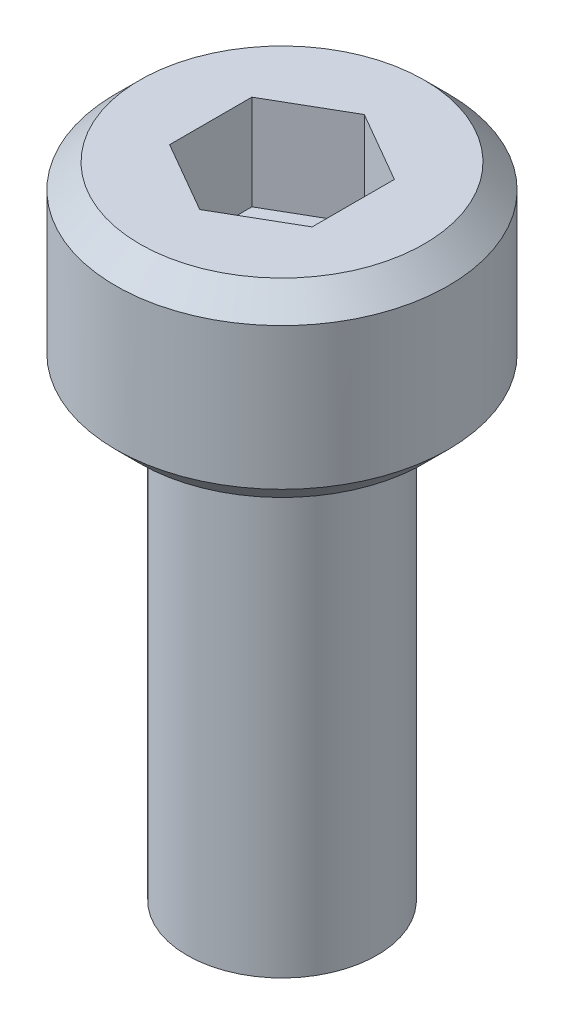
ISO-10303-21;
HEADER;
FILE_DESCRIPTION(('STEP AP214'),'2;1');
FILE_NAME('part.step','',(''),(''),'','','');
FILE_SCHEMA(('AUTOMOTIVE_DESIGN { 1 0 10303 214 1 1 1 1 }'));
ENDSEC;
DATA;
#1=APPLICATION_CONTEXT('core data for automotive mechanical design processes');
#2=APPLICATION_PROTOCOL_DEFINITION('international standard','automotive_design',2000,#1);
#3=PRODUCT_CONTEXT('',#1,'mechanical');
#4=PRODUCT('Part','Part','',(#3));
#5=PRODUCT_RELATED_PRODUCT_CATEGORY('part','',(#4));
#6=PRODUCT_DEFINITION_FORMATION('','',#4);
#7=PRODUCT_DEFINITION_CONTEXT('part definition',#1,'design');
#8=PRODUCT_DEFINITION('design','',#6,#7);
#9=PRODUCT_DEFINITION_SHAPE('','',#8);
#10=(LENGTH_UNIT() NAMED_UNIT(*) SI_UNIT(.MILLI.,.METRE.));
#11=(NAMED_UNIT(*) PLANE_ANGLE_UNIT() SI_UNIT($,.RADIAN.));
#12=(NAMED_UNIT(*) SI_UNIT($,.STERADIAN.) SOLID_ANGLE_UNIT());
#13=UNCERTAINTY_MEASURE_WITH_UNIT(LENGTH_MEASURE(1.E-05),#10,'distance_accuracy_value','');
#14=(GEOMETRIC_REPRESENTATION_CONTEXT(3) GLOBAL_UNCERTAINTY_ASSIGNED_CONTEXT((#13)) GLOBAL_UNIT_ASSIGNED_CONTEXT((#10,
#11,#12)) REPRESENTATION_CONTEXT('',''));
#15=CARTESIAN_POINT('',(0.,0.,0.));
#16=DIRECTION('',(0.,0.,1.));
#17=DIRECTION('',(1.,0.,0.));
#18=AXIS2_PLACEMENT_3D('',#15,#16,#17);
#19=CARTESIAN_POINT('',(0.,1.99999199999999,-1.73205080756887));
#20=DIRECTION('',(-0.5,0.,-0.866025403784439));
#21=DIRECTION('',(-0.866025403784439,0.,0.5));
#22=AXIS2_PLACEMENT_3D('',#19,#20,#21);
#23=PLANE('',#22);
#24=DIRECTION('',(0.,-1.,0.));
#25=VECTOR('',#24,1.);
#26=CARTESIAN_POINT('',(-1.49999999999999,1.99999199999999,-0.866025403784432));
#27=LINE('',#26,#25);
#28=CARTESIAN_POINT('',(-1.49999999999999,3.99999199999999,-0.866025403784429));
#29=VERTEX_POINT('',#28);
#30=CARTESIAN_POINT('',(-1.49999999999999,1.99999199999999,-0.866025403784429));
#31=VERTEX_POINT('',#30);
#32=EDGE_CURVE('E83',#29,#31,#27,.T.);
#33=ORIENTED_EDGE('',*,*,#32,.T.);
#34=DIRECTION('',(-0.866025403784439,0.,0.5));
#35=VECTOR('',#34,1.);
#36=CARTESIAN_POINT('',(0.,1.99999199999999,-1.73205080756887));
#37=LINE('',#36,#35);
#38=CARTESIAN_POINT('',(0.,1.999992,-1.73205080756887));
#39=VERTEX_POINT('',#38);
#40=EDGE_CURVE('E72',#39,#31,#37,.T.);
#41=ORIENTED_EDGE('',*,*,#40,.F.);
#42=DIRECTION('',(0.,1.,0.));
#43=VECTOR('',#42,1.);
#44=CARTESIAN_POINT('',(0.,1.99999200000003,-1.73205080756886));
#45=LINE('',#44,#43);
#46=CARTESIAN_POINT('',(0.,3.99999200000001,-1.73205080756887));
#47=VERTEX_POINT('',#46);
#48=EDGE_CURVE('E92',#39,#47,#45,.T.);
#49=ORIENTED_EDGE('',*,*,#48,.T.);
#50=DIRECTION('',(-0.866025403784439,0.,0.5));
#51=VECTOR('',#50,1.);
#52=CARTESIAN_POINT('',(0.,3.99999199999999,-1.73205080756887));
#53=LINE('',#52,#51);
#54=EDGE_CURVE('E67',#29,#47,#53,.F.);
#55=ORIENTED_EDGE('',*,*,#54,.F.);
#56=EDGE_LOOP('',(#33,#41,#49,#55));
#57=FACE_BOUND('',#56,.T.);
#58=ADVANCED_FACE('F17',(#57),#23,.F.);
#59=CARTESIAN_POINT('',(-1.49999999999999,1.99999199999999,-0.866025403784432));
#60=DIRECTION('',(-1.,0.,0.));
#61=DIRECTION('',(0.,-1.,0.));
#62=AXIS2_PLACEMENT_3D('',#59,#60,#61);
#63=PLANE('',#62);
#64=DIRECTION('',(0.,1.,0.));
#65=VECTOR('',#64,1.);
#66=CARTESIAN_POINT('',(-1.49999999999999,1.99999199999999,0.866025403784441));
#67=LINE('',#66,#65);
#68=CARTESIAN_POINT('',(-1.49999999999999,3.99999199999999,0.866025403784443));
#69=VERTEX_POINT('',#68);
#70=CARTESIAN_POINT('',(-1.49999999999999,1.99999199999999,0.866025403784439));
#71=VERTEX_POINT('',#70);
#72=EDGE_CURVE('E88',#69,#71,#67,.F.);
#73=ORIENTED_EDGE('',*,*,#72,.T.);
#74=DIRECTION('',(0.,0.,1.));
#75=VECTOR('',#74,1.);
#76=CARTESIAN_POINT('',(-1.49999999999999,1.99999199999999,-0.866025403784432));
#77=LINE('',#76,#75);
#78=EDGE_CURVE('E76',#31,#71,#77,.T.);
#79=ORIENTED_EDGE('',*,*,#78,.F.);
#80=ORIENTED_EDGE('',*,*,#32,.F.);
#81=DIRECTION('',(0.,0.,1.));
#82=VECTOR('',#81,1.);
#83=CARTESIAN_POINT('',(-1.49999999999999,3.99999199999999,-0.866025403784432));
#84=LINE('',#83,#82);
#85=EDGE_CURVE('E90',#69,#29,#84,.F.);
#86=ORIENTED_EDGE('',*,*,#85,.F.);
#87=EDGE_LOOP('',(#73,#79,#80,#86));
#88=FACE_BOUND('',#87,.T.);
#89=ADVANCED_FACE('F86',(#88),#63,.F.);
#90=CARTESIAN_POINT('',(1.50000000000001,1.99999200000003,-0.866025403784422));
#91=DIRECTION('',(0.5,0.,-0.866025403784439));
#92=DIRECTION('',(-0.866025403784439,0.,-0.5));
#93=AXIS2_PLACEMENT_3D('',#90,#91,#92);
#94=PLANE('',#93);
#95=ORIENTED_EDGE('',*,*,#48,.F.);
#96=DIRECTION('',(-0.866025403784436,0.,-0.500000000000005));
#97=VECTOR('',#96,1.);
#98=CARTESIAN_POINT('',(1.50000000000001,1.99999199999999,-0.866025403784422));
#99=LINE('',#98,#97);
#100=CARTESIAN_POINT('',(1.5,1.999992,-0.866025403784425));
#101=VERTEX_POINT('',#100);
#102=EDGE_CURVE('E79',#101,#39,#99,.T.);
#103=ORIENTED_EDGE('',*,*,#102,.F.);
#104=DIRECTION('',(0.,1.,0.));
#105=VECTOR('',#104,1.);
#106=CARTESIAN_POINT('',(1.5,1.99999199999999,-0.866025403784422));
#107=LINE('',#106,#105);
#108=CARTESIAN_POINT('',(1.5,3.99999200000002,-0.866025403784425));
#109=VERTEX_POINT('',#108);
#110=EDGE_CURVE('E122',#101,#109,#107,.T.);
#111=ORIENTED_EDGE('',*,*,#110,.T.);
#112=DIRECTION('',(-0.866025403784439,0.,-0.5));
#113=VECTOR('',#112,1.);
#114=CARTESIAN_POINT('',(1.50000000000001,3.99999200000005,-0.866025403784422));
#115=LINE('',#114,#113);
#116=EDGE_CURVE('E134',#47,#109,#115,.F.);
#117=ORIENTED_EDGE('',*,*,#116,.F.);
#118=EDGE_LOOP('',(#95,#103,#111,#117));
#119=FACE_BOUND('',#118,.T.);
#120=ADVANCED_FACE('F137',(#119),#94,.F.);
#121=CARTESIAN_POINT('',(-1.49999999999999,1.99999199999999,0.866025403784439));
#122=DIRECTION('',(-0.5,0.,0.866025403784439));
#123=DIRECTION('',(0.866025403784439,0.,0.5));
#124=AXIS2_PLACEMENT_3D('',#121,#122,#123);
#125=PLANE('',#124);
#126=DIRECTION('',(0.,1.,0.));
#127=VECTOR('',#126,1.);
#128=CARTESIAN_POINT('',(0.,1.99999199999999,1.73205080756887));
#129=LINE('',#128,#127);
#130=CARTESIAN_POINT('',(0.,3.99999199999999,1.73205080756888));
#131=VERTEX_POINT('',#130);
#132=CARTESIAN_POINT('',(0.,1.99999199999999,1.73205080756887));
#133=VERTEX_POINT('',#132);
#134=EDGE_CURVE('E119',#131,#133,#129,.F.);
#135=ORIENTED_EDGE('',*,*,#134,.T.);
#136=DIRECTION('',(0.86602540378444,0.,0.499999999999998));
#137=VECTOR('',#136,1.);
#138=CARTESIAN_POINT('',(-1.49999999999999,1.99999199999999,0.866025403784439));
#139=LINE('',#138,#137);
#140=EDGE_CURVE('E128',#71,#133,#139,.T.);
#141=ORIENTED_EDGE('',*,*,#140,.F.);
#142=ORIENTED_EDGE('',*,*,#72,.F.);
#143=DIRECTION('',(0.866025403784439,0.,0.5));
#144=VECTOR('',#143,1.);
#145=CARTESIAN_POINT('',(-1.49999999999999,3.99999199999999,0.866025403784439));
#146=LINE('',#145,#144);
#147=EDGE_CURVE('E130',#131,#69,#146,.F.);
#148=ORIENTED_EDGE('',*,*,#147,.F.);
#149=EDGE_LOOP('',(#135,#141,#142,#148));
#150=FACE_BOUND('',#149,.T.);
#151=ADVANCED_FACE('F144',(#150),#125,.F.);
#152=CARTESIAN_POINT('',(1.5,1.99999199999999,2.5980762113533));
#153=DIRECTION('',(0.,1.,0.));
#154=DIRECTION('',(0.,0.,1.));
#155=AXIS2_PLACEMENT_3D('',#152,#153,#154);
#156=PLANE('',#155);
#157=ORIENTED_EDGE('',*,*,#40,.T.);
#158=ORIENTED_EDGE('',*,*,#78,.T.);
#159=ORIENTED_EDGE('',*,*,#140,.T.);
#160=DIRECTION('',(0.866025403784439,0.,-0.5));
#161=VECTOR('',#160,1.);
#162=CARTESIAN_POINT('',(0.,1.99999199999999,1.73205080756887));
#163=LINE('',#162,#161);
#164=CARTESIAN_POINT('',(1.5,1.99999199999999,0.866025403784437));
#165=VERTEX_POINT('',#164);
#166=EDGE_CURVE('E117',#133,#165,#163,.T.);
#167=ORIENTED_EDGE('',*,*,#166,.T.);
#168=DIRECTION('',(0.,0.,1.));
#169=VECTOR('',#168,1.);
#170=CARTESIAN_POINT('',(1.5,1.99999199999999,0.866025403784439));
#171=LINE('',#170,#169);
#172=EDGE_CURVE('E125',#165,#101,#171,.F.);
#173=ORIENTED_EDGE('',*,*,#172,.T.);
#174=ORIENTED_EDGE('',*,*,#102,.T.);
#175=EDGE_LOOP('',(#157,#158,#159,#167,#173,#174));
#176=FACE_BOUND('',#175,.T.);
#177=ADVANCED_FACE('F73',(#176),#156,.T.);
#178=CARTESIAN_POINT('',(1.5,1.99999199999999,0.866025403784439));
#179=DIRECTION('',(1.,0.,0.));
#180=DIRECTION('',(0.,1.,0.));
#181=AXIS2_PLACEMENT_3D('',#178,#179,#180);
#182=PLANE('',#181);
#183=ORIENTED_EDGE('',*,*,#110,.F.);
#184=ORIENTED_EDGE('',*,*,#172,.F.);
#185=DIRECTION('',(0.,1.,0.));
#186=VECTOR('',#185,1.);
#187=CARTESIAN_POINT('',(1.5,1.99999199999999,0.866025403784431));
#188=LINE('',#187,#186);
#189=CARTESIAN_POINT('',(1.5,3.99999199999999,0.866025403784437));
#190=VERTEX_POINT('',#189);
#191=EDGE_CURVE('E115',#165,#190,#188,.T.);
#192=ORIENTED_EDGE('',*,*,#191,.T.);
#193=DIRECTION('',(0.,0.,1.));
#194=VECTOR('',#193,1.);
#195=CARTESIAN_POINT('',(1.5,3.99999199999999,0.866025403784439));
#196=LINE('',#195,#194);
#197=EDGE_CURVE('E35',#109,#190,#196,.T.);
#198=ORIENTED_EDGE('',*,*,#197,.F.);
#199=EDGE_LOOP('',(#183,#184,#192,#198));
#200=FACE_BOUND('',#199,.T.);
#201=ADVANCED_FACE('F151',(#200),#182,.F.);
#202=CARTESIAN_POINT('',(0.,1.99999199999999,1.73205080756887));
#203=DIRECTION('',(0.5,0.,0.866025403784439));
#204=DIRECTION('',(0.866025403784439,0.,-0.5));
#205=AXIS2_PLACEMENT_3D('',#202,#203,#204);
#206=PLANE('',#205);
#207=ORIENTED_EDGE('',*,*,#191,.F.);
#208=ORIENTED_EDGE('',*,*,#166,.F.);
#209=ORIENTED_EDGE('',*,*,#134,.F.);
#210=DIRECTION('',(-0.866025403784435,0.,0.500000000000006));
#211=VECTOR('',#210,1.);
#212=CARTESIAN_POINT('',(1.5,3.99999199999999,0.866025403784439));
#213=LINE('',#212,#211);
#214=EDGE_CURVE('E113',#190,#131,#213,.T.);
#215=ORIENTED_EDGE('',*,*,#214,.F.);
#216=EDGE_LOOP('',(#207,#208,#209,#215));
#217=FACE_BOUND('',#216,.T.);
#218=ADVANCED_FACE('F149',(#217),#206,.F.);
#219=CARTESIAN_POINT('',(0.,3.99999199999999,0.));
#220=DIRECTION('',(0.,1.,0.));
#221=DIRECTION('',(0.,0.,1.));
#222=AXIS2_PLACEMENT_3D('',#219,#220,#221);
#223=PLANE('',#222);
#224=ORIENTED_EDGE('',*,*,#197,.T.);
#225=ORIENTED_EDGE('',*,*,#214,.T.);
#226=ORIENTED_EDGE('',*,*,#147,.T.);
#227=ORIENTED_EDGE('',*,*,#85,.T.);
#228=ORIENTED_EDGE('',*,*,#54,.T.);
#229=ORIENTED_EDGE('',*,*,#116,.T.);
#230=EDGE_LOOP('',(#224,#225,#226,#227,#228,#229));
#231=FACE_BOUND('',#230,.T.);
#232=CARTESIAN_POINT('',(0.,3.99999199993317,0.));
#233=DIRECTION('',(0.,-1.,0.));
#234=DIRECTION('',(0.,0.,-1.));
#235=AXIS2_PLACEMENT_3D('',#232,#233,#234);
#236=CIRCLE('',#235,2.9920000000061);
#237=CARTESIAN_POINT('',(0.,3.99999199993317,-2.9920000000061));
#238=VERTEX_POINT('',#237);
#239=EDGE_CURVE('E20',#238,#238,#236,.T.);
#240=ORIENTED_EDGE('',*,*,#239,.F.);
#241=EDGE_LOOP('',(#240));
#242=FACE_BOUND('',#241,.T.);
#243=ADVANCED_FACE('F139',(#231,#242),#223,.T.);
#244=CARTESIAN_POINT('',(0.,3.49199200013572,0.));
#245=DIRECTION('',(0.,-1.,0.));
#246=DIRECTION('',(0.,0.,-1.));
#247=AXIS2_PLACEMENT_3D('',#244,#245,#246);
#248=CONICAL_SURFACE('',#247,3.49999999980355,0.785398163397448);
#249=ORIENTED_EDGE('',*,*,#239,.T.);
#250=EDGE_LOOP('',(#249));
#251=FACE_BOUND('',#250,.T.);
#252=CARTESIAN_POINT('',(0.,3.491992,0.));
#253=DIRECTION('',(0.,-1.,0.));
#254=DIRECTION('',(0.,0.,-1.));
#255=AXIS2_PLACEMENT_3D('',#252,#253,#254);
#256=CIRCLE('',#255,3.5);
#257=CARTESIAN_POINT('',(0.,3.491992,-3.5));
#258=VERTEX_POINT('',#257);
#259=EDGE_CURVE('E105',#258,#258,#256,.T.);
#260=ORIENTED_EDGE('',*,*,#259,.F.);
#261=EDGE_LOOP('',(#260));
#262=FACE_BOUND('',#261,.T.);
#263=ADVANCED_FACE('F188',(#251,#262),#248,.T.);
#264=CARTESIAN_POINT('',(0.,3.99999199999999,0.));
#265=DIRECTION('',(0.,-1.,0.));
#266=DIRECTION('',(0.,0.,-1.));
#267=AXIS2_PLACEMENT_3D('',#264,#265,#266);
#268=CYLINDRICAL_SURFACE('',#267,3.5);
#269=ORIENTED_EDGE('',*,*,#259,.T.);
#270=EDGE_LOOP('',(#269));
#271=FACE_BOUND('',#270,.T.);
#272=CARTESIAN_POINT('',(0.,0.507999999967979,0.));
#273=DIRECTION('',(0.,1.,0.));
#274=DIRECTION('',(0.,0.,1.));
#275=AXIS2_PLACEMENT_3D('',#272,#273,#274);
#276=CIRCLE('',#275,3.49999999997408);
#277=CARTESIAN_POINT('',(0.,0.507999999967979,3.49999999997408));
#278=VERTEX_POINT('',#277);
#279=EDGE_CURVE('E101',#278,#278,#276,.F.);
#280=ORIENTED_EDGE('',*,*,#279,.F.);
#281=EDGE_LOOP('',(#280));
#282=FACE_BOUND('',#281,.T.);
#283=ADVANCED_FACE('F184',(#271,#282),#268,.T.);
#284=CARTESIAN_POINT('',(0.,-10.,0.));
#285=DIRECTION('',(0.,1.,0.));
#286=DIRECTION('',(0.,0.,1.));
#287=AXIS2_PLACEMENT_3D('',#284,#285,#286);
#288=PLANE('',#287);
#289=CARTESIAN_POINT('',(0.,-10.000000000008,0.));
#290=DIRECTION('',(0.,1.,0.));
#291=DIRECTION('',(0.,0.,1.));
#292=AXIS2_PLACEMENT_3D('',#289,#290,#291);
#293=CIRCLE('',#292,1.23037999998133);
#294=CARTESIAN_POINT('',(0.,-10.000000000008,1.23037999998132));
#295=VERTEX_POINT('',#294);
#296=EDGE_CURVE('E99',#295,#295,#293,.T.);
#297=ORIENTED_EDGE('',*,*,#296,.F.);
#298=EDGE_LOOP('',(#297));
#299=FACE_BOUND('',#298,.T.);
#300=ADVANCED_FACE('F180',(#299),#288,.F.);
#301=CARTESIAN_POINT('',(0.,0.508000000024822,0.));
#302=DIRECTION('',(0.,1.,0.));
#303=DIRECTION('',(0.,0.,1.));
#304=AXIS2_PLACEMENT_3D('',#301,#302,#303);
#305=CONICAL_SURFACE('',#304,3.50000000008777,0.785398163453397);
#306=CARTESIAN_POINT('',(0.,0.,0.));
#307=DIRECTION('',(0.,1.,0.));
#308=DIRECTION('',(0.,0.,1.));
#309=AXIS2_PLACEMENT_3D('',#306,#307,#308);
#310=CIRCLE('',#309,2.9920000000061);
#311=CARTESIAN_POINT('',(0.,0.,2.9920000000061));
#312=VERTEX_POINT('',#311);
#313=EDGE_CURVE('E97',#312,#312,#310,.T.);
#314=ORIENTED_EDGE('',*,*,#313,.T.);
#315=EDGE_LOOP('',(#314));
#316=FACE_BOUND('',#315,.T.);
#317=ORIENTED_EDGE('',*,*,#279,.T.);
#318=EDGE_LOOP('',(#317));
#319=FACE_BOUND('',#318,.T.);
#320=ADVANCED_FACE('F176',(#316,#319),#305,.T.);
#321=CARTESIAN_POINT('',(0.,-9.46152000000211,0.));
#322=DIRECTION('',(0.,1.,0.));
#323=DIRECTION('',(0.,0.,1.));
#324=AXIS2_PLACEMENT_3D('',#321,#322,#323);
#325=CONICAL_SURFACE('',#324,1.99999999989587,0.960291895353206);
#326=CARTESIAN_POINT('',(0.,-9.46152,0.));
#327=DIRECTION('',(0.,1.,0.));
#328=DIRECTION('',(0.,0.,1.));
#329=AXIS2_PLACEMENT_3D('',#326,#327,#328);
#330=CIRCLE('',#329,2.);
#331=CARTESIAN_POINT('',(0.,-9.46152,1.99999999999999));
#332=VERTEX_POINT('',#331);
#333=EDGE_CURVE('E26',#332,#332,#330,.T.);
#334=ORIENTED_EDGE('',*,*,#333,.F.);
#335=EDGE_LOOP('',(#334));
#336=FACE_BOUND('',#335,.T.);
#337=ORIENTED_EDGE('',*,*,#296,.T.);
#338=EDGE_LOOP('',(#337));
#339=FACE_BOUND('',#338,.T.);
#340=ADVANCED_FACE('F169',(#336,#339),#325,.T.);
#341=CARTESIAN_POINT('',(0.,0.,0.));
#342=DIRECTION('',(0.,1.,0.));
#343=DIRECTION('',(0.,0.,1.));
#344=AXIS2_PLACEMENT_3D('',#341,#342,#343);
#345=PLANE('',#344);
#346=CARTESIAN_POINT('',(0.,0.,0.));
#347=DIRECTION('',(0.,1.,0.));
#348=DIRECTION('',(0.,0.,1.));
#349=AXIS2_PLACEMENT_3D('',#346,#347,#348);
#350=CIRCLE('',#349,2.);
#351=CARTESIAN_POINT('',(0.,0.,1.99999999999999));
#352=VERTEX_POINT('',#351);
#353=EDGE_CURVE('E11',#352,#352,#350,.F.);
#354=ORIENTED_EDGE('',*,*,#353,.F.);
#355=EDGE_LOOP('',(#354));
#356=FACE_BOUND('',#355,.T.);
#357=ORIENTED_EDGE('',*,*,#313,.F.);
#358=EDGE_LOOP('',(#357));
#359=FACE_BOUND('',#358,.T.);
#360=ADVANCED_FACE('F163',(#356,#359),#345,.F.);
#361=CARTESIAN_POINT('',(0.,-10.,0.));
#362=DIRECTION('',(0.,1.,0.));
#363=DIRECTION('',(0.,0.,1.));
#364=AXIS2_PLACEMENT_3D('',#361,#362,#363);
#365=CYLINDRICAL_SURFACE('',#364,2.);
#366=ORIENTED_EDGE('',*,*,#353,.T.);
#367=EDGE_LOOP('',(#366));
#368=FACE_BOUND('',#367,.T.);
#369=ORIENTED_EDGE('',*,*,#333,.T.);
#370=EDGE_LOOP('',(#369));
#371=FACE_BOUND('',#370,.T.);
#372=ADVANCED_FACE('F161',(#368,#371),#365,.T.);
#373=CLOSED_SHELL('',(#58,#89,#120,#151,#177,#201,#218,#243,#263,#283,#300,#320,#340,#360,#372));
#374=MANIFOLD_SOLID_BREP('B1',#373);
#375=ADVANCED_BREP_SHAPE_REPRESENTATION('',(#18,#374),#14);
#376=SHAPE_DEFINITION_REPRESENTATION(#9,#375);
ENDSEC;
END-ISO-10303-21;
